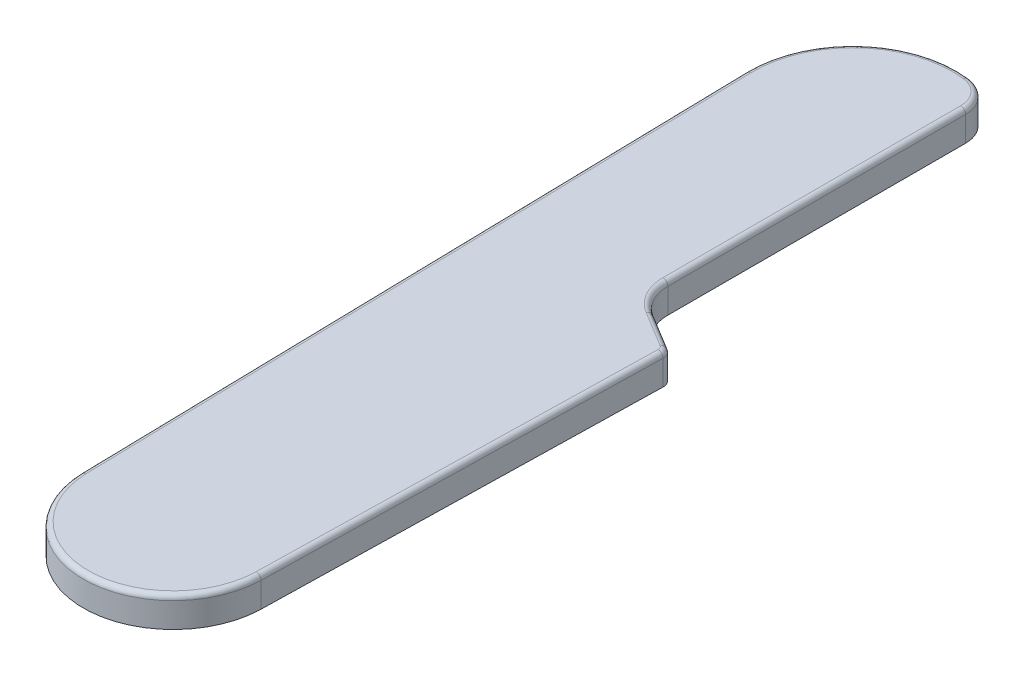
ISO-10303-21;
HEADER;
FILE_DESCRIPTION(('STEP AP214'),'2;1');
FILE_NAME('part.step','',(''),(''),'','','');
FILE_SCHEMA(('AUTOMOTIVE_DESIGN { 1 0 10303 214 1 1 1 1 }'));
ENDSEC;
DATA;
#1=APPLICATION_CONTEXT('core data for automotive mechanical design processes');
#2=APPLICATION_PROTOCOL_DEFINITION('international standard','automotive_design',2000,#1);
#3=PRODUCT_CONTEXT('',#1,'mechanical');
#4=PRODUCT('Part','Part','',(#3));
#5=PRODUCT_RELATED_PRODUCT_CATEGORY('part','',(#4));
#6=PRODUCT_DEFINITION_FORMATION('','',#4);
#7=PRODUCT_DEFINITION_CONTEXT('part definition',#1,'design');
#8=PRODUCT_DEFINITION('design','',#6,#7);
#9=PRODUCT_DEFINITION_SHAPE('','',#8);
#10=(LENGTH_UNIT() NAMED_UNIT(*) SI_UNIT(.MILLI.,.METRE.));
#11=(NAMED_UNIT(*) PLANE_ANGLE_UNIT() SI_UNIT($,.RADIAN.));
#12=(NAMED_UNIT(*) SI_UNIT($,.STERADIAN.) SOLID_ANGLE_UNIT());
#13=UNCERTAINTY_MEASURE_WITH_UNIT(LENGTH_MEASURE(1.E-05),#10,'distance_accuracy_value','');
#14=(GEOMETRIC_REPRESENTATION_CONTEXT(3) GLOBAL_UNCERTAINTY_ASSIGNED_CONTEXT((#13)) GLOBAL_UNIT_ASSIGNED_CONTEXT((#10,
#11,#12)) REPRESENTATION_CONTEXT('',''));
#15=CARTESIAN_POINT('',(0.,0.,0.));
#16=DIRECTION('',(0.,0.,1.));
#17=DIRECTION('',(1.,0.,0.));
#18=AXIS2_PLACEMENT_3D('',#15,#16,#17);
#19=CARTESIAN_POINT('',(8.85698531517435,3.,-39.1878110364307));
#20=DIRECTION('',(0.,-1.,0.));
#21=DIRECTION('',(0.,0.,-1.));
#22=AXIS2_PLACEMENT_3D('',#19,#20,#21);
#23=CYLINDRICAL_SURFACE('',#22,1.);
#24=DIRECTION('',(0.,-1.,0.));
#25=VECTOR('',#24,1.);
#26=CARTESIAN_POINT('',(9.37575857333486,3.,-40.0427229071037));
#27=LINE('',#26,#25);
#28=CARTESIAN_POINT('',(9.37575857333486,2.5,-40.0427229071037));
#29=VERTEX_POINT('',#28);
#30=CARTESIAN_POINT('',(9.37575857333487,0.,-40.0427229071037));
#31=VERTEX_POINT('',#30);
#32=EDGE_CURVE('E193',#29,#31,#27,.T.);
#33=ORIENTED_EDGE('',*,*,#32,.F.);
#34=CARTESIAN_POINT('',(8.85698531517435,2.5,-39.1878110364307));
#35=DIRECTION('',(0.,1.,0.));
#36=DIRECTION('',(0.,0.,1.));
#37=AXIS2_PLACEMENT_3D('',#34,#35,#36);
#38=CIRCLE('',#37,1.);
#39=CARTESIAN_POINT('',(9.85674734225426,2.5,-39.1659961513962));
#40=VERTEX_POINT('',#39);
#41=EDGE_CURVE('E45',#29,#40,#38,.F.);
#42=ORIENTED_EDGE('',*,*,#41,.T.);
#43=DIRECTION('',(0.,-1.,0.));
#44=VECTOR('',#43,1.);
#45=CARTESIAN_POINT('',(9.85674734225426,3.,-39.1659961513962));
#46=LINE('',#45,#44);
#47=CARTESIAN_POINT('',(9.85674734225426,0.,-39.1659961513962));
#48=VERTEX_POINT('',#47);
#49=EDGE_CURVE('E195',#48,#40,#46,.F.);
#50=ORIENTED_EDGE('',*,*,#49,.F.);
#51=CARTESIAN_POINT('',(8.85698531517435,0.,-39.1878110364307));
#52=DIRECTION('',(0.,1.,0.));
#53=DIRECTION('',(0.,0.,1.));
#54=AXIS2_PLACEMENT_3D('',#51,#52,#53);
#55=CIRCLE('',#54,1.);
#56=EDGE_CURVE('E155',#31,#48,#55,.F.);
#57=ORIENTED_EDGE('',*,*,#56,.F.);
#58=EDGE_LOOP('',(#33,#42,#50,#57));
#59=FACE_BOUND('',#58,.T.);
#60=ADVANCED_FACE('F36',(#59),#23,.T.);
#61=CARTESIAN_POINT('',(0.869342172001296,3.,-75.4327452585786));
#62=DIRECTION('',(0.,-1.,0.));
#63=DIRECTION('',(0.,0.,-1.));
#64=AXIS2_PLACEMENT_3D('',#61,#62,#63);
#65=CYLINDRICAL_SURFACE('',#64,3.);
#66=DIRECTION('',(0.,-1.,0.));
#67=VECTOR('',#66,1.);
#68=CARTESIAN_POINT('',(1.21784983835102,3.,-78.4124335655154));
#69=LINE('',#68,#67);
#70=CARTESIAN_POINT('',(1.21784983835102,2.5,-78.4124335655154));
#71=VERTEX_POINT('',#70);
#72=CARTESIAN_POINT('',(1.21784983835103,0.,-78.4124335655154));
#73=VERTEX_POINT('',#72);
#74=EDGE_CURVE('E186',#71,#73,#69,.T.);
#75=ORIENTED_EDGE('',*,*,#74,.F.);
#76=CARTESIAN_POINT('',(0.869342172001296,2.5,-75.4327452585786));
#77=DIRECTION('',(0.,1.,0.));
#78=DIRECTION('',(0.,0.,1.));
#79=AXIS2_PLACEMENT_3D('',#76,#77,#78);
#80=CIRCLE('',#79,3.);
#81=CARTESIAN_POINT('',(3.8693421720013,2.5,-75.4327452585786));
#82=VERTEX_POINT('',#81);
#83=EDGE_CURVE('E223',#71,#82,#80,.F.);
#84=ORIENTED_EDGE('',*,*,#83,.T.);
#85=DIRECTION('',(0.,-1.,0.));
#86=VECTOR('',#85,1.);
#87=CARTESIAN_POINT('',(3.8693421720013,3.,-75.4327452585786));
#88=LINE('',#87,#86);
#89=CARTESIAN_POINT('',(3.8693421720013,0.,-75.4327452585786));
#90=VERTEX_POINT('',#89);
#91=EDGE_CURVE('E188',#90,#82,#88,.F.);
#92=ORIENTED_EDGE('',*,*,#91,.F.);
#93=CARTESIAN_POINT('',(0.869342172001296,0.,-75.4327452585786));
#94=DIRECTION('',(0.,1.,0.));
#95=DIRECTION('',(0.,0.,1.));
#96=AXIS2_PLACEMENT_3D('',#93,#94,#95);
#97=CIRCLE('',#96,3.);
#98=EDGE_CURVE('E191',#73,#90,#97,.F.);
#99=ORIENTED_EDGE('',*,*,#98,.F.);
#100=EDGE_LOOP('',(#75,#84,#92,#99));
#101=FACE_BOUND('',#100,.T.);
#102=ADVANCED_FACE('F275',(#101),#65,.T.);
#103=CARTESIAN_POINT('',(7.8693421720013,3.,-45.6356836656231));
#104=DIRECTION('',(0.,1.,0.));
#105=DIRECTION('',(0.,0.,1.));
#106=AXIS2_PLACEMENT_3D('',#103,#104,#105);
#107=CYLINDRICAL_SURFACE('',#106,4.);
#108=DIRECTION('',(0.,-1.,0.));
#109=VECTOR('',#108,1.);
#110=CARTESIAN_POINT('',(3.8693421720013,3.,-45.6356836656231));
#111=LINE('',#110,#109);
#112=CARTESIAN_POINT('',(3.8693421720013,2.5,-45.6356836656231));
#113=VERTEX_POINT('',#112);
#114=CARTESIAN_POINT('',(3.8693421720013,0.,-45.6356836656231));
#115=VERTEX_POINT('',#114);
#116=EDGE_CURVE('E145',#113,#115,#111,.T.);
#117=ORIENTED_EDGE('',*,*,#116,.F.);
#118=CARTESIAN_POINT('',(7.8693421720013,2.5,-45.6356836656231));
#119=DIRECTION('',(0.,1.,0.));
#120=DIRECTION('',(0.,0.,1.));
#121=AXIS2_PLACEMENT_3D('',#118,#119,#120);
#122=CIRCLE('',#121,4.);
#123=CARTESIAN_POINT('',(5.79424913935924,2.5,-42.2160361829313));
#124=VERTEX_POINT('',#123);
#125=EDGE_CURVE('E227',#113,#124,#122,.T.);
#126=ORIENTED_EDGE('',*,*,#125,.T.);
#127=DIRECTION('',(0.,-1.,0.));
#128=VECTOR('',#127,1.);
#129=CARTESIAN_POINT('',(5.79424913935924,3.,-42.2160361829313));
#130=LINE('',#129,#128);
#131=CARTESIAN_POINT('',(5.79424913935924,0.,-42.2160361829313));
#132=VERTEX_POINT('',#131);
#133=EDGE_CURVE('E181',#132,#124,#130,.F.);
#134=ORIENTED_EDGE('',*,*,#133,.F.);
#135=CARTESIAN_POINT('',(7.8693421720013,0.,-45.6356836656231));
#136=DIRECTION('',(0.,1.,0.));
#137=DIRECTION('',(0.,0.,1.));
#138=AXIS2_PLACEMENT_3D('',#135,#136,#137);
#139=CIRCLE('',#138,4.);
#140=EDGE_CURVE('E183',#132,#115,#139,.F.);
#141=ORIENTED_EDGE('',*,*,#140,.T.);
#142=EDGE_LOOP('',(#117,#126,#134,#141));
#143=FACE_BOUND('',#142,.T.);
#144=ADVANCED_FACE('F267',(#143),#107,.F.);
#145=CARTESIAN_POINT('',(0.,3.,0.));
#146=DIRECTION('',(0.,-1.,0.));
#147=DIRECTION('',(0.,0.,-1.));
#148=AXIS2_PLACEMENT_3D('',#145,#146,#147);
#149=CYLINDRICAL_SURFACE('',#148,9.);
#150=DIRECTION('',(0.,-1.,0.));
#151=VECTOR('',#150,1.);
#152=CARTESIAN_POINT('',(8.99785824371918,3.,0.196333965311017));
#153=LINE('',#152,#151);
#154=CARTESIAN_POINT('',(8.99785824371918,2.5,0.196333965311017));
#155=VERTEX_POINT('',#154);
#156=CARTESIAN_POINT('',(8.99785824371918,0.,0.196333965311017));
#157=VERTEX_POINT('',#156);
#158=EDGE_CURVE('E136',#155,#157,#153,.T.);
#159=ORIENTED_EDGE('',*,*,#158,.F.);
#160=CARTESIAN_POINT('',(0.,2.5,0.));
#161=DIRECTION('',(0.,1.,0.));
#162=DIRECTION('',(0.,0.,1.));
#163=AXIS2_PLACEMENT_3D('',#160,#161,#162);
#164=CIRCLE('',#163,9.);
#165=CARTESIAN_POINT('',(-8.99785824371918,2.5,0.196333965311017));
#166=VERTEX_POINT('',#165);
#167=EDGE_CURVE('E217',#155,#166,#164,.F.);
#168=ORIENTED_EDGE('',*,*,#167,.T.);
#169=DIRECTION('',(0.,-1.,0.));
#170=VECTOR('',#169,1.);
#171=CARTESIAN_POINT('',(-8.99785824371918,3.,0.196333965311017));
#172=LINE('',#171,#170);
#173=CARTESIAN_POINT('',(-8.99785824371918,0.,0.196333965311017));
#174=VERTEX_POINT('',#173);
#175=EDGE_CURVE('E160',#166,#174,#172,.T.);
#176=ORIENTED_EDGE('',*,*,#175,.T.);
#177=CARTESIAN_POINT('',(0.,0.,0.));
#178=DIRECTION('',(0.,1.,0.));
#179=DIRECTION('',(0.,0.,1.));
#180=AXIS2_PLACEMENT_3D('',#177,#178,#179);
#181=CIRCLE('',#180,9.);
#182=EDGE_CURVE('E153',#174,#157,#181,.T.);
#183=ORIENTED_EDGE('',*,*,#182,.T.);
#184=EDGE_LOOP('',(#159,#168,#176,#183));
#185=FACE_BOUND('',#184,.T.);
#186=ADVANCED_FACE('F158',(#185),#149,.T.);
#187=CARTESIAN_POINT('',(9.8693421720013,3.,-39.7432090268563));
#188=DIRECTION('',(-0.999762027079909,0.,-0.0218148850345574));
#189=DIRECTION('',(-0.0218148850345574,0.,0.999762027079909));
#190=AXIS2_PLACEMENT_3D('',#187,#188,#189);
#191=PLANE('',#190);
#192=ORIENTED_EDGE('',*,*,#49,.T.);
#193=DIRECTION('',(0.0218148850345574,0.,-0.999762027079909));
#194=VECTOR('',#193,1.);
#195=CARTESIAN_POINT('',(8.99785824371918,2.5,0.196333965311017));
#196=LINE('',#195,#194);
#197=EDGE_CURVE('E11',#40,#155,#196,.F.);
#198=ORIENTED_EDGE('',*,*,#197,.T.);
#199=ORIENTED_EDGE('',*,*,#158,.T.);
#200=DIRECTION('',(0.0218148850345574,0.,-0.999762027079909));
#201=VECTOR('',#200,1.);
#202=CARTESIAN_POINT('',(9.8693421720013,0.,-39.7432090268563));
#203=LINE('',#202,#201);
#204=EDGE_CURVE('E139',#157,#48,#203,.T.);
#205=ORIENTED_EDGE('',*,*,#204,.T.);
#206=EDGE_LOOP('',(#192,#198,#199,#205));
#207=FACE_BOUND('',#206,.T.);
#208=ADVANCED_FACE('F138',(#207),#191,.F.);
#209=CARTESIAN_POINT('',(3.8693421720013,3.,-43.3840984047438));
#210=DIRECTION('',(-0.518773258160515,0.,0.85491187067295));
#211=DIRECTION('',(0.854911870672951,0.,0.518773258160515));
#212=AXIS2_PLACEMENT_3D('',#209,#210,#211);
#213=PLANE('',#212);
#214=ORIENTED_EDGE('',*,*,#133,.T.);
#215=DIRECTION('',(-0.854911870672951,0.,-0.518773258160515));
#216=VECTOR('',#215,1.);
#217=CARTESIAN_POINT('',(9.37575857333486,2.5,-40.0427229071037));
#218=LINE('',#217,#216);
#219=EDGE_CURVE('E60',#124,#29,#218,.F.);
#220=ORIENTED_EDGE('',*,*,#219,.T.);
#221=ORIENTED_EDGE('',*,*,#32,.T.);
#222=DIRECTION('',(-0.854911870672951,0.,-0.518773258160515));
#223=VECTOR('',#222,1.);
#224=CARTESIAN_POINT('',(3.8693421720013,0.,-43.3840984047438));
#225=LINE('',#224,#223);
#226=EDGE_CURVE('E156',#31,#132,#225,.T.);
#227=ORIENTED_EDGE('',*,*,#226,.T.);
#228=EDGE_LOOP('',(#214,#220,#221,#227));
#229=FACE_BOUND('',#228,.T.);
#230=ADVANCED_FACE('F486',(#229),#213,.F.);
#231=CARTESIAN_POINT('',(3.8693421720013,3.,-77.7432090268563));
#232=DIRECTION('',(-1.,0.,0.));
#233=DIRECTION('',(0.,0.,1.));
#234=AXIS2_PLACEMENT_3D('',#231,#232,#233);
#235=PLANE('',#234);
#236=ORIENTED_EDGE('',*,*,#91,.T.);
#237=DIRECTION('',(0.,0.,-1.));
#238=VECTOR('',#237,1.);
#239=CARTESIAN_POINT('',(3.8693421720013,2.5,-45.6356836656231));
#240=LINE('',#239,#238);
#241=EDGE_CURVE('E225',#82,#113,#240,.F.);
#242=ORIENTED_EDGE('',*,*,#241,.T.);
#243=ORIENTED_EDGE('',*,*,#116,.T.);
#244=DIRECTION('',(0.,0.,-1.));
#245=VECTOR('',#244,1.);
#246=CARTESIAN_POINT('',(3.8693421720013,0.,-77.7432090268563));
#247=LINE('',#246,#245);
#248=EDGE_CURVE('E170',#115,#90,#247,.T.);
#249=ORIENTED_EDGE('',*,*,#248,.T.);
#250=EDGE_LOOP('',(#236,#242,#243,#249));
#251=FACE_BOUND('',#250,.T.);
#252=ADVANCED_FACE('F264',(#251),#235,.F.);
#253=CARTESIAN_POINT('',(0.,3.,-68.));
#254=DIRECTION('',(0.,-1.,0.));
#255=DIRECTION('',(0.,0.,-1.));
#256=AXIS2_PLACEMENT_3D('',#253,#254,#255);
#257=CYLINDRICAL_SURFACE('',#256,10.4834121823499);
#258=DIRECTION('',(0.,-1.,0.));
#259=VECTOR('',#258,1.);
#260=CARTESIAN_POINT('',(-10.4809174141404,3.,-67.7713055684722));
#261=LINE('',#260,#259);
#262=CARTESIAN_POINT('',(-10.4809174141404,2.5,-67.7713055684722));
#263=VERTEX_POINT('',#262);
#264=CARTESIAN_POINT('',(-10.4809174141404,0.,-67.7713055684722));
#265=VERTEX_POINT('',#264);
#266=EDGE_CURVE('E146',#263,#265,#261,.T.);
#267=ORIENTED_EDGE('',*,*,#266,.F.);
#268=CARTESIAN_POINT('',(0.,2.5,-68.));
#269=DIRECTION('',(0.,1.,0.));
#270=DIRECTION('',(0.,0.,1.));
#271=AXIS2_PLACEMENT_3D('',#268,#269,#270);
#272=CIRCLE('',#271,10.4834121823499);
#273=EDGE_CURVE('E221',#263,#71,#272,.F.);
#274=ORIENTED_EDGE('',*,*,#273,.T.);
#275=ORIENTED_EDGE('',*,*,#74,.T.);
#276=CARTESIAN_POINT('',(0.,0.,-68.));
#277=DIRECTION('',(0.,1.,0.));
#278=DIRECTION('',(0.,0.,-1.));
#279=AXIS2_PLACEMENT_3D('',#276,#277,#278);
#280=CIRCLE('',#279,10.4834121823499);
#281=EDGE_CURVE('E173',#73,#265,#280,.T.);
#282=ORIENTED_EDGE('',*,*,#281,.T.);
#283=EDGE_LOOP('',(#267,#274,#275,#282));
#284=FACE_BOUND('',#283,.T.);
#285=ADVANCED_FACE('F278',(#284),#257,.T.);
#286=CARTESIAN_POINT('',(-8.99785824371918,3.,0.196333965311017));
#287=DIRECTION('',(0.999762027079909,0.,-0.0218148850345575));
#288=DIRECTION('',(-0.0218148850345575,0.,-0.999762027079909));
#289=AXIS2_PLACEMENT_3D('',#286,#287,#288);
#290=PLANE('',#289);
#291=ORIENTED_EDGE('',*,*,#175,.F.);
#292=DIRECTION('',(0.0218148850345575,0.,0.999762027079909));
#293=VECTOR('',#292,1.);
#294=CARTESIAN_POINT('',(-10.4809174141404,2.5,-67.7713055684722));
#295=LINE('',#294,#293);
#296=EDGE_CURVE('E219',#166,#263,#295,.F.);
#297=ORIENTED_EDGE('',*,*,#296,.T.);
#298=ORIENTED_EDGE('',*,*,#266,.T.);
#299=DIRECTION('',(0.0218148850345575,0.,0.999762027079909));
#300=VECTOR('',#299,1.);
#301=CARTESIAN_POINT('',(-8.99785824371918,0.,0.196333965311017));
#302=LINE('',#301,#300);
#303=EDGE_CURVE('E176',#265,#174,#302,.T.);
#304=ORIENTED_EDGE('',*,*,#303,.T.);
#305=EDGE_LOOP('',(#291,#297,#298,#304));
#306=FACE_BOUND('',#305,.T.);
#307=ADVANCED_FACE('F311',(#306),#290,.F.);
#308=CARTESIAN_POINT('',(0.,3.,0.));
#309=DIRECTION('',(0.,1.,0.));
#310=DIRECTION('',(0.,0.,1.));
#311=AXIS2_PLACEMENT_3D('',#308,#309,#310);
#312=PLANE('',#311);
#313=DIRECTION('',(0.0218148850345575,0.,0.999762027079909));
#314=VECTOR('',#313,1.);
#315=CARTESIAN_POINT('',(-8.49797723017923,3.,0.185426522793738));
#316=LINE('',#315,#314);
#317=CARTESIAN_POINT('',(-9.9810364006004,3.,-67.7822130109894));
#318=VERTEX_POINT('',#317);
#319=CARTESIAN_POINT('',(-8.49797723017923,3.,0.185426522793738));
#320=VERTEX_POINT('',#319);
#321=EDGE_CURVE('E212',#318,#320,#316,.T.);
#322=ORIENTED_EDGE('',*,*,#321,.T.);
#323=CARTESIAN_POINT('',(0.,3.,0.));
#324=DIRECTION('',(0.,1.,0.));
#325=DIRECTION('',(0.,0.,1.));
#326=AXIS2_PLACEMENT_3D('',#323,#324,#325);
#327=CIRCLE('',#326,8.5);
#328=CARTESIAN_POINT('',(8.49797723017923,3.,0.185426522793738));
#329=VERTEX_POINT('',#328);
#330=EDGE_CURVE('E214',#320,#329,#327,.T.);
#331=ORIENTED_EDGE('',*,*,#330,.T.);
#332=DIRECTION('',(0.0218148850345574,0.,-0.999762027079909));
#333=VECTOR('',#332,1.);
#334=CARTESIAN_POINT('',(9.3568663287143,3.,-39.1769035939135));
#335=LINE('',#334,#333);
#336=CARTESIAN_POINT('',(9.3568663287143,3.,-39.1769035939135));
#337=VERTEX_POINT('',#336);
#338=EDGE_CURVE('E198',#329,#337,#335,.T.);
#339=ORIENTED_EDGE('',*,*,#338,.T.);
#340=CARTESIAN_POINT('',(8.85698531517435,3.,-39.1878110364307));
#341=DIRECTION('',(0.,1.,0.));
#342=DIRECTION('',(0.,0.,1.));
#343=AXIS2_PLACEMENT_3D('',#340,#341,#342);
#344=CIRCLE('',#343,0.5);
#345=CARTESIAN_POINT('',(9.11637194425461,3.,-39.6152669717672));
#346=VERTEX_POINT('',#345);
#347=EDGE_CURVE('E200',#337,#346,#344,.T.);
#348=ORIENTED_EDGE('',*,*,#347,.T.);
#349=DIRECTION('',(-0.854911870672951,0.,-0.518773258160515));
#350=VECTOR('',#349,1.);
#351=CARTESIAN_POINT('',(5.53486251027898,3.,-41.7885802475948));
#352=LINE('',#351,#350);
#353=CARTESIAN_POINT('',(5.53486251027898,3.,-41.7885802475948));
#354=VERTEX_POINT('',#353);
#355=EDGE_CURVE('E202',#346,#354,#352,.T.);
#356=ORIENTED_EDGE('',*,*,#355,.T.);
#357=CARTESIAN_POINT('',(7.8693421720013,3.,-45.6356836656231));
#358=DIRECTION('',(0.,1.,0.));
#359=DIRECTION('',(0.,0.,1.));
#360=AXIS2_PLACEMENT_3D('',#357,#358,#359);
#361=CIRCLE('',#360,4.5);
#362=CARTESIAN_POINT('',(3.3693421720013,3.,-45.6356836656231));
#363=VERTEX_POINT('',#362);
#364=EDGE_CURVE('E204',#354,#363,#361,.F.);
#365=ORIENTED_EDGE('',*,*,#364,.T.);
#366=DIRECTION('',(0.,0.,-1.));
#367=VECTOR('',#366,1.);
#368=CARTESIAN_POINT('',(3.3693421720013,3.,-75.4327452585786));
#369=LINE('',#368,#367);
#370=CARTESIAN_POINT('',(3.3693421720013,3.,-75.4327452585786));
#371=VERTEX_POINT('',#370);
#372=EDGE_CURVE('E206',#363,#371,#369,.T.);
#373=ORIENTED_EDGE('',*,*,#372,.T.);
#374=CARTESIAN_POINT('',(0.869342172001296,3.,-75.4327452585786));
#375=DIRECTION('',(0.,1.,0.));
#376=DIRECTION('',(0.,0.,1.));
#377=AXIS2_PLACEMENT_3D('',#374,#375,#376);
#378=CIRCLE('',#377,2.5);
#379=CARTESIAN_POINT('',(1.15976522729274,3.,-77.9158188476926));
#380=VERTEX_POINT('',#379);
#381=EDGE_CURVE('E208',#371,#380,#378,.T.);
#382=ORIENTED_EDGE('',*,*,#381,.T.);
#383=CARTESIAN_POINT('',(0.,3.,-68.));
#384=DIRECTION('',(0.,1.,0.));
#385=DIRECTION('',(0.,0.,1.));
#386=AXIS2_PLACEMENT_3D('',#383,#384,#385);
#387=CIRCLE('',#386,9.9834121823499);
#388=EDGE_CURVE('E210',#380,#318,#387,.T.);
#389=ORIENTED_EDGE('',*,*,#388,.T.);
#390=EDGE_LOOP('',(#322,#331,#339,#348,#356,#365,#373,#382,#389));
#391=FACE_BOUND('',#390,.T.);
#392=ADVANCED_FACE('F291',(#391),#312,.T.);
#393=CARTESIAN_POINT('',(0.,0.,0.));
#394=DIRECTION('',(0.,1.,0.));
#395=DIRECTION('',(0.,0.,1.));
#396=AXIS2_PLACEMENT_3D('',#393,#394,#395);
#397=PLANE('',#396);
#398=CARTESIAN_POINT('',(-2.70506215575307,0.,-1.67));
#399=DIRECTION('',(0.,-1.,0.));
#400=DIRECTION('',(0.,0.,-1.));
#401=AXIS2_PLACEMENT_3D('',#398,#399,#400);
#402=CIRCLE('',#401,1.);
#403=CARTESIAN_POINT('',(-2.70506215575307,0.,-2.67));
#404=VERTEX_POINT('',#403);
#405=EDGE_CURVE('E382',#404,#404,#402,.T.);
#406=ORIENTED_EDGE('',*,*,#405,.F.);
#407=EDGE_LOOP('',(#406));
#408=FACE_BOUND('',#407,.T.);
#409=CARTESIAN_POINT('',(6.76984482044394,0.,-35.2160361829313));
#410=DIRECTION('',(0.,-1.,0.));
#411=DIRECTION('',(0.,0.,-1.));
#412=AXIS2_PLACEMENT_3D('',#409,#410,#411);
#413=CIRCLE('',#412,1.);
#414=CARTESIAN_POINT('',(6.76984482044394,0.,-36.2160361829313));
#415=VERTEX_POINT('',#414);
#416=EDGE_CURVE('E390',#415,#415,#413,.T.);
#417=ORIENTED_EDGE('',*,*,#416,.F.);
#418=EDGE_LOOP('',(#417));
#419=FACE_BOUND('',#418,.T.);
#420=CARTESIAN_POINT('',(-5.39907000133261,0.,-69.6166137620408));
#421=DIRECTION('',(0.,-1.,0.));
#422=DIRECTION('',(0.,0.,-1.));
#423=AXIS2_PLACEMENT_3D('',#420,#421,#422);
#424=CIRCLE('',#423,1.);
#425=CARTESIAN_POINT('',(-5.39907000133261,0.,-70.6166137620408));
#426=VERTEX_POINT('',#425);
#427=EDGE_CURVE('E166',#426,#426,#424,.T.);
#428=ORIENTED_EDGE('',*,*,#427,.F.);
#429=EDGE_LOOP('',(#428));
#430=FACE_BOUND('',#429,.T.);
#431=ORIENTED_EDGE('',*,*,#226,.F.);
#432=ORIENTED_EDGE('',*,*,#56,.T.);
#433=ORIENTED_EDGE('',*,*,#204,.F.);
#434=ORIENTED_EDGE('',*,*,#182,.F.);
#435=ORIENTED_EDGE('',*,*,#303,.F.);
#436=ORIENTED_EDGE('',*,*,#281,.F.);
#437=ORIENTED_EDGE('',*,*,#98,.T.);
#438=ORIENTED_EDGE('',*,*,#248,.F.);
#439=ORIENTED_EDGE('',*,*,#140,.F.);
#440=EDGE_LOOP('',(#431,#432,#433,#434,#435,#436,#437,#438,#439));
#441=FACE_BOUND('',#440,.T.);
#442=ADVANCED_FACE('F151',(#408,#419,#430,#441),#397,.F.);
#443=CARTESIAN_POINT('',(3.36934217200131,2.5,0.));
#444=DIRECTION('',(0.,0.,1.));
#445=DIRECTION('',(1.,0.,0.));
#446=AXIS2_PLACEMENT_3D('',#443,#444,#445);
#447=CYLINDRICAL_SURFACE('',#446,0.5);
#448=CARTESIAN_POINT('',(3.3693421720013,2.5,-75.4327452585786));
#449=DIRECTION('',(0.,0.,-1.));
#450=DIRECTION('',(-1.,0.,0.));
#451=AXIS2_PLACEMENT_3D('',#448,#449,#450);
#452=CIRCLE('',#451,0.5);
#453=EDGE_CURVE('E164',#371,#82,#452,.T.);
#454=ORIENTED_EDGE('',*,*,#453,.F.);
#455=ORIENTED_EDGE('',*,*,#372,.F.);
#456=CARTESIAN_POINT('',(3.3693421720013,2.5,-45.6356836656231));
#457=DIRECTION('',(0.,0.,1.));
#458=DIRECTION('',(1.,0.,0.));
#459=AXIS2_PLACEMENT_3D('',#456,#457,#458);
#460=CIRCLE('',#459,0.5);
#461=EDGE_CURVE('E40',#113,#363,#460,.T.);
#462=ORIENTED_EDGE('',*,*,#461,.F.);
#463=ORIENTED_EDGE('',*,*,#241,.F.);
#464=EDGE_LOOP('',(#454,#455,#462,#463));
#465=FACE_BOUND('',#464,.T.);
#466=ADVANCED_FACE('F38',(#465),#447,.T.);
#467=CARTESIAN_POINT('',(7.8693421720013,2.5,-45.6356836656231));
#468=DIRECTION('',(0.,1.,0.));
#469=DIRECTION('',(0.,0.,1.));
#470=AXIS2_PLACEMENT_3D('',#467,#468,#469);
#471=TOROIDAL_SURFACE('',#470,4.5,0.5);
#472=ORIENTED_EDGE('',*,*,#461,.T.);
#473=ORIENTED_EDGE('',*,*,#364,.F.);
#474=CARTESIAN_POINT('',(5.53486251027898,2.5,-41.7885802475948));
#475=DIRECTION('',(0.85491187067295,0.,0.518773258160516));
#476=DIRECTION('',(0.518773258160516,0.,-0.85491187067295));
#477=AXIS2_PLACEMENT_3D('',#474,#475,#476);
#478=CIRCLE('',#477,0.5);
#479=EDGE_CURVE('E248',#124,#354,#478,.T.);
#480=ORIENTED_EDGE('',*,*,#479,.F.);
#481=ORIENTED_EDGE('',*,*,#125,.F.);
#482=EDGE_LOOP('',(#472,#473,#480,#481));
#483=FACE_BOUND('',#482,.T.);
#484=ADVANCED_FACE('F296',(#483),#471,.T.);
#485=CARTESIAN_POINT('',(0.869342172001296,2.5,-75.4327452585786));
#486=DIRECTION('',(0.,1.,0.));
#487=DIRECTION('',(0.,0.,1.));
#488=AXIS2_PLACEMENT_3D('',#485,#486,#487);
#489=TOROIDAL_SURFACE('',#488,2.5,0.5);
#490=ORIENTED_EDGE('',*,*,#453,.T.);
#491=ORIENTED_EDGE('',*,*,#83,.F.);
#492=CARTESIAN_POINT('',(1.15976522729274,2.5,-77.9158188476926));
#493=DIRECTION('',(-0.993229435645577,0.,-0.116169222116573));
#494=DIRECTION('',(-0.116169222116573,0.,0.993229435645577));
#495=AXIS2_PLACEMENT_3D('',#492,#493,#494);
#496=CIRCLE('',#495,0.5);
#497=EDGE_CURVE('E245',#380,#71,#496,.T.);
#498=ORIENTED_EDGE('',*,*,#497,.F.);
#499=ORIENTED_EDGE('',*,*,#381,.F.);
#500=EDGE_LOOP('',(#490,#491,#498,#499));
#501=FACE_BOUND('',#500,.T.);
#502=ADVANCED_FACE('F255',(#501),#489,.T.);
#503=CARTESIAN_POINT('',(20.0230354022324,2.5,-32.9969411163763));
#504=DIRECTION('',(0.854911870672951,0.,0.518773258160515));
#505=DIRECTION('',(0.518773258160515,0.,-0.854911870672951));
#506=AXIS2_PLACEMENT_3D('',#503,#504,#505);
#507=CYLINDRICAL_SURFACE('',#506,0.5);
#508=ORIENTED_EDGE('',*,*,#479,.T.);
#509=ORIENTED_EDGE('',*,*,#355,.F.);
#510=CARTESIAN_POINT('',(9.11637194425461,2.5,-39.6152669717672));
#511=DIRECTION('',(0.854911870672951,0.,0.518773258160514));
#512=DIRECTION('',(0.518773258160514,0.,-0.854911870672951));
#513=AXIS2_PLACEMENT_3D('',#510,#511,#512);
#514=CIRCLE('',#513,0.5);
#515=EDGE_CURVE('E242',#29,#346,#514,.T.);
#516=ORIENTED_EDGE('',*,*,#515,.F.);
#517=ORIENTED_EDGE('',*,*,#219,.F.);
#518=EDGE_LOOP('',(#508,#509,#516,#517));
#519=FACE_BOUND('',#518,.T.);
#520=ADVANCED_FACE('F298',(#519),#507,.T.);
#521=CARTESIAN_POINT('',(0.,2.5,-68.));
#522=DIRECTION('',(0.,1.,0.));
#523=DIRECTION('',(0.,0.,1.));
#524=AXIS2_PLACEMENT_3D('',#521,#522,#523);
#525=TOROIDAL_SURFACE('',#524,9.9834121823499,0.5);
#526=ORIENTED_EDGE('',*,*,#497,.T.);
#527=ORIENTED_EDGE('',*,*,#273,.F.);
#528=CARTESIAN_POINT('',(-9.9810364006004,2.5,-67.7822130109894));
#529=DIRECTION('',(0.0218148850345545,0.,0.999762027079909));
#530=DIRECTION('',(0.999762027079909,0.,-0.0218148850345545));
#531=AXIS2_PLACEMENT_3D('',#528,#529,#530);
#532=CIRCLE('',#531,0.5);
#533=EDGE_CURVE('E239',#318,#263,#532,.T.);
#534=ORIENTED_EDGE('',*,*,#533,.F.);
#535=ORIENTED_EDGE('',*,*,#388,.F.);
#536=EDGE_LOOP('',(#526,#527,#534,#535));
#537=FACE_BOUND('',#536,.T.);
#538=ADVANCED_FACE('F282',(#537),#525,.T.);
#539=CARTESIAN_POINT('',(8.85698531517435,2.5,-39.1878110364307));
#540=DIRECTION('',(0.,1.,0.));
#541=DIRECTION('',(0.,0.,1.));
#542=AXIS2_PLACEMENT_3D('',#539,#540,#541);
#543=DEGENERATE_TOROIDAL_SURFACE('',#542,0.5,0.5,.T.);
#544=ORIENTED_EDGE('',*,*,#515,.T.);
#545=ORIENTED_EDGE('',*,*,#347,.F.);
#546=CARTESIAN_POINT('',(9.3568663287143,2.5,-39.1769035939135));
#547=DIRECTION('',(-0.0218148850345545,0.,0.999762027079909));
#548=DIRECTION('',(0.999762027079909,0.,0.0218148850345545));
#549=AXIS2_PLACEMENT_3D('',#546,#547,#548);
#550=CIRCLE('',#549,0.5);
#551=EDGE_CURVE('E236',#40,#337,#550,.T.);
#552=ORIENTED_EDGE('',*,*,#551,.F.);
#553=ORIENTED_EDGE('',*,*,#41,.F.);
#554=EDGE_LOOP('',(#544,#545,#552,#553));
#555=FACE_BOUND('',#554,.T.);
#556=ADVANCED_FACE('F303',(#555),#543,.T.);
#557=CARTESIAN_POINT('',(-8.49797723017923,2.5,0.185426522793738));
#558=DIRECTION('',(-0.0218148850345575,0.,-0.999762027079909));
#559=DIRECTION('',(-0.999762027079909,0.,0.0218148850345575));
#560=AXIS2_PLACEMENT_3D('',#557,#558,#559);
#561=CYLINDRICAL_SURFACE('',#560,0.5);
#562=ORIENTED_EDGE('',*,*,#533,.T.);
#563=ORIENTED_EDGE('',*,*,#296,.F.);
#564=CARTESIAN_POINT('',(-8.49797723017923,2.5,0.185426522793738));
#565=DIRECTION('',(0.0218148850345574,0.,0.999762027079909));
#566=DIRECTION('',(0.999762027079909,0.,-0.0218148850345574));
#567=AXIS2_PLACEMENT_3D('',#564,#565,#566);
#568=CIRCLE('',#567,0.5);
#569=EDGE_CURVE('E233',#320,#166,#568,.T.);
#570=ORIENTED_EDGE('',*,*,#569,.F.);
#571=ORIENTED_EDGE('',*,*,#321,.F.);
#572=EDGE_LOOP('',(#562,#563,#570,#571));
#573=FACE_BOUND('',#572,.T.);
#574=ADVANCED_FACE('F287',(#573),#561,.T.);
#575=CARTESIAN_POINT('',(8.49797723017923,2.5,0.185426522793738));
#576=DIRECTION('',(-0.0218148850345574,0.,0.999762027079909));
#577=DIRECTION('',(0.999762027079909,0.,0.0218148850345574));
#578=AXIS2_PLACEMENT_3D('',#575,#576,#577);
#579=CYLINDRICAL_SURFACE('',#578,0.5);
#580=ORIENTED_EDGE('',*,*,#551,.T.);
#581=ORIENTED_EDGE('',*,*,#338,.F.);
#582=CARTESIAN_POINT('',(8.49797723017923,2.5,0.185426522793738));
#583=DIRECTION('',(-0.0218148850345574,0.,0.999762027079909));
#584=DIRECTION('',(0.999762027079909,0.,0.0218148850345574));
#585=AXIS2_PLACEMENT_3D('',#582,#583,#584);
#586=CIRCLE('',#585,0.5);
#587=EDGE_CURVE('E231',#155,#329,#586,.T.);
#588=ORIENTED_EDGE('',*,*,#587,.F.);
#589=ORIENTED_EDGE('',*,*,#197,.F.);
#590=EDGE_LOOP('',(#580,#581,#588,#589));
#591=FACE_BOUND('',#590,.T.);
#592=ADVANCED_FACE('F307',(#591),#579,.T.);
#593=CARTESIAN_POINT('',(0.,2.5,0.));
#594=DIRECTION('',(0.,1.,0.));
#595=DIRECTION('',(0.,0.,1.));
#596=AXIS2_PLACEMENT_3D('',#593,#594,#595);
#597=TOROIDAL_SURFACE('',#596,8.5,0.5);
#598=ORIENTED_EDGE('',*,*,#569,.T.);
#599=ORIENTED_EDGE('',*,*,#167,.F.);
#600=ORIENTED_EDGE('',*,*,#587,.T.);
#601=ORIENTED_EDGE('',*,*,#330,.F.);
#602=EDGE_LOOP('',(#598,#599,#600,#601));
#603=FACE_BOUND('',#602,.T.);
#604=ADVANCED_FACE('F309',(#603),#597,.T.);
#605=CARTESIAN_POINT('',(-5.39907000133261,2.,-69.6166137620408));
#606=DIRECTION('',(0.,-1.,0.));
#607=DIRECTION('',(0.,0.,-1.));
#608=AXIS2_PLACEMENT_3D('',#605,#606,#607);
#609=CYLINDRICAL_SURFACE('',#608,1.);
#610=CARTESIAN_POINT('',(-5.39907000133261,2.,-69.6166137620408));
#611=DIRECTION('',(0.,-1.,0.));
#612=DIRECTION('',(0.,0.,-1.));
#613=AXIS2_PLACEMENT_3D('',#610,#611,#612);
#614=CIRCLE('',#613,1.);
#615=CARTESIAN_POINT('',(-5.39907000133261,2.,-70.6166137620408));
#616=VERTEX_POINT('',#615);
#617=EDGE_CURVE('E392',#616,#616,#614,.T.);
#618=ORIENTED_EDGE('',*,*,#617,.F.);
#619=EDGE_LOOP('',(#618));
#620=FACE_BOUND('',#619,.T.);
#621=ORIENTED_EDGE('',*,*,#427,.T.);
#622=EDGE_LOOP('',(#621));
#623=FACE_BOUND('',#622,.T.);
#624=ADVANCED_FACE('F331',(#620,#623),#609,.F.);
#625=CARTESIAN_POINT('',(-5.39907000133261,2.,-69.6166137620408));
#626=DIRECTION('',(0.,-1.,0.));
#627=DIRECTION('',(0.,0.,-1.));
#628=AXIS2_PLACEMENT_3D('',#625,#626,#627);
#629=PLANE('',#628);
#630=ORIENTED_EDGE('',*,*,#617,.T.);
#631=EDGE_LOOP('',(#630));
#632=FACE_BOUND('',#631,.T.);
#633=ADVANCED_FACE('F358',(#632),#629,.T.);
#634=CARTESIAN_POINT('',(6.76984482044394,2.,-35.2160361829313));
#635=DIRECTION('',(0.,-1.,0.));
#636=DIRECTION('',(0.,0.,-1.));
#637=AXIS2_PLACEMENT_3D('',#634,#635,#636);
#638=CYLINDRICAL_SURFACE('',#637,1.);
#639=CARTESIAN_POINT('',(6.76984482044394,2.,-35.2160361829313));
#640=DIRECTION('',(0.,-1.,0.));
#641=DIRECTION('',(0.,0.,-1.));
#642=AXIS2_PLACEMENT_3D('',#639,#640,#641);
#643=CIRCLE('',#642,1.);
#644=CARTESIAN_POINT('',(6.76984482044394,2.,-36.2160361829313));
#645=VERTEX_POINT('',#644);
#646=EDGE_CURVE('E385',#645,#645,#643,.T.);
#647=ORIENTED_EDGE('',*,*,#646,.F.);
#648=EDGE_LOOP('',(#647));
#649=FACE_BOUND('',#648,.T.);
#650=ORIENTED_EDGE('',*,*,#416,.T.);
#651=EDGE_LOOP('',(#650));
#652=FACE_BOUND('',#651,.T.);
#653=ADVANCED_FACE('F362',(#649,#652),#638,.F.);
#654=CARTESIAN_POINT('',(6.76984482044394,2.,-35.2160361829313));
#655=DIRECTION('',(0.,-1.,0.));
#656=DIRECTION('',(0.,0.,-1.));
#657=AXIS2_PLACEMENT_3D('',#654,#655,#656);
#658=PLANE('',#657);
#659=ORIENTED_EDGE('',*,*,#646,.T.);
#660=EDGE_LOOP('',(#659));
#661=FACE_BOUND('',#660,.T.);
#662=ADVANCED_FACE('F366',(#661),#658,.T.);
#663=CARTESIAN_POINT('',(-2.70506215575307,2.,-1.67));
#664=DIRECTION('',(0.,-1.,0.));
#665=DIRECTION('',(0.,0.,-1.));
#666=AXIS2_PLACEMENT_3D('',#663,#664,#665);
#667=CYLINDRICAL_SURFACE('',#666,1.);
#668=CARTESIAN_POINT('',(-2.70506215575307,2.,-1.67));
#669=DIRECTION('',(0.,-1.,0.));
#670=DIRECTION('',(0.,0.,-1.));
#671=AXIS2_PLACEMENT_3D('',#668,#669,#670);
#672=CIRCLE('',#671,1.);
#673=CARTESIAN_POINT('',(-2.70506215575307,2.,-2.67));
#674=VERTEX_POINT('',#673);
#675=EDGE_CURVE('E234',#674,#674,#672,.T.);
#676=ORIENTED_EDGE('',*,*,#675,.F.);
#677=EDGE_LOOP('',(#676));
#678=FACE_BOUND('',#677,.T.);
#679=ORIENTED_EDGE('',*,*,#405,.T.);
#680=EDGE_LOOP('',(#679));
#681=FACE_BOUND('',#680,.T.);
#682=ADVANCED_FACE('F370',(#678,#681),#667,.F.);
#683=CARTESIAN_POINT('',(-2.70506215575307,2.,-1.67));
#684=DIRECTION('',(0.,-1.,0.));
#685=DIRECTION('',(0.,0.,-1.));
#686=AXIS2_PLACEMENT_3D('',#683,#684,#685);
#687=PLANE('',#686);
#688=ORIENTED_EDGE('',*,*,#675,.T.);
#689=EDGE_LOOP('',(#688));
#690=FACE_BOUND('',#689,.T.);
#691=ADVANCED_FACE('F374',(#690),#687,.T.);
#692=CLOSED_SHELL('',(#60,#102,#144,#186,#208,#230,#252,#285,#307,#392,#442,#466,#484,#502,#520,
#538,#556,#574,#592,#604,#624,#633,#653,#662,#682,#691));
#693=MANIFOLD_SOLID_BREP('B2',#692);
#694=ADVANCED_BREP_SHAPE_REPRESENTATION('',(#18,#693),#14);
#695=SHAPE_DEFINITION_REPRESENTATION(#9,#694);
ENDSEC;
END-ISO-10303-21;
